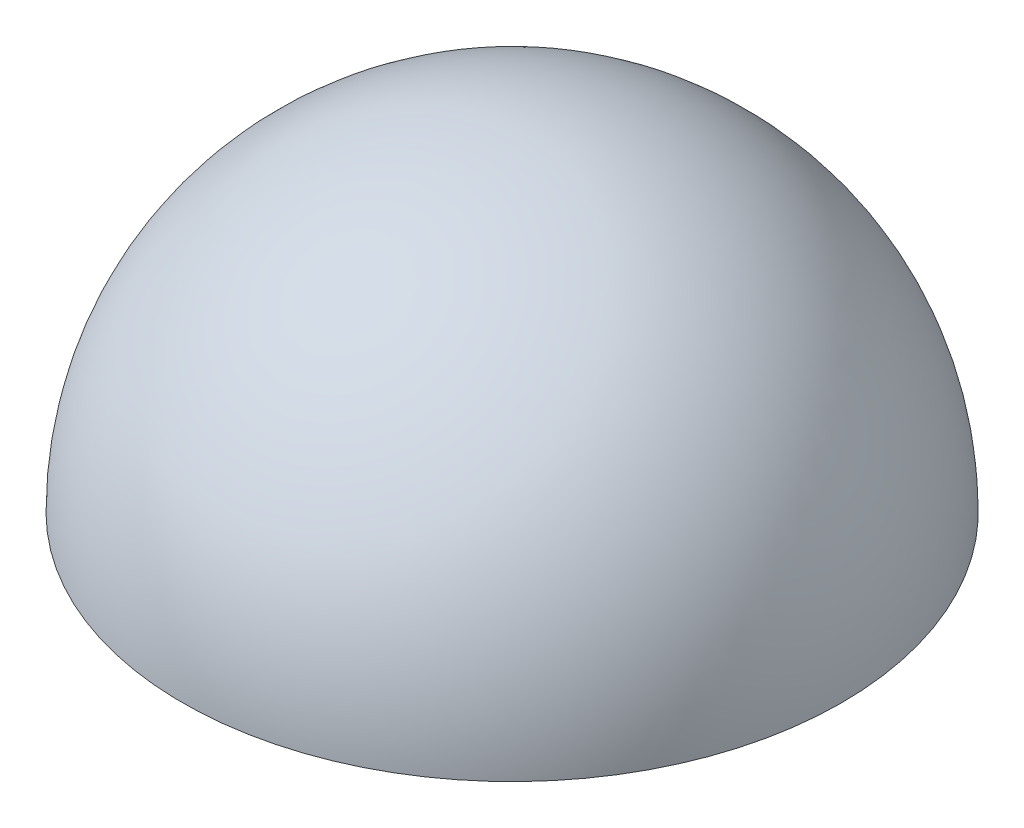
ISO-10303-21;
HEADER;
FILE_DESCRIPTION(('STEP AP214'),'2;1');
FILE_NAME('part.step','',(''),(''),'','','');
FILE_SCHEMA(('AUTOMOTIVE_DESIGN { 1 0 10303 214 1 1 1 1 }'));
ENDSEC;
DATA;
#1=APPLICATION_CONTEXT('core data for automotive mechanical design processes');
#2=APPLICATION_PROTOCOL_DEFINITION('international standard','automotive_design',2000,#1);
#3=PRODUCT_CONTEXT('',#1,'mechanical');
#4=PRODUCT('Part','Part','',(#3));
#5=PRODUCT_RELATED_PRODUCT_CATEGORY('part','',(#4));
#6=PRODUCT_DEFINITION_FORMATION('','',#4);
#7=PRODUCT_DEFINITION_CONTEXT('part definition',#1,'design');
#8=PRODUCT_DEFINITION('design','',#6,#7);
#9=PRODUCT_DEFINITION_SHAPE('','',#8);
#10=(LENGTH_UNIT() NAMED_UNIT(*) SI_UNIT(.MILLI.,.METRE.));
#11=(NAMED_UNIT(*) PLANE_ANGLE_UNIT() SI_UNIT($,.RADIAN.));
#12=(NAMED_UNIT(*) SI_UNIT($,.STERADIAN.) SOLID_ANGLE_UNIT());
#13=UNCERTAINTY_MEASURE_WITH_UNIT(LENGTH_MEASURE(1.E-05),#10,'distance_accuracy_value','');
#14=(GEOMETRIC_REPRESENTATION_CONTEXT(3) GLOBAL_UNCERTAINTY_ASSIGNED_CONTEXT((#13)) GLOBAL_UNIT_ASSIGNED_CONTEXT((#10,
#11,#12)) REPRESENTATION_CONTEXT('',''));
#15=CARTESIAN_POINT('',(0.,0.,0.));
#16=DIRECTION('',(0.,0.,1.));
#17=DIRECTION('',(1.,0.,0.));
#18=AXIS2_PLACEMENT_3D('',#15,#16,#17);
#19=CARTESIAN_POINT('',(-14.1918639717501,0.,-8.92807835927719));
#20=DIRECTION('',(0.294975335032854,0.,0.955504867450844));
#21=DIRECTION('',(0.955504867450844,0.,-0.294975335032854));
#22=AXIS2_PLACEMENT_3D('',#19,#20,#21);
#23=SPHERICAL_SURFACE('',#22,18.75);
#24=CARTESIAN_POINT('',(-14.1918639717501,0.,-8.92807835927719));
#25=DIRECTION('',(0.,-1.,0.));
#26=DIRECTION('',(0.563700736803671,0.,0.825979103444511));
#27=AXIS2_PLACEMENT_3D('',#24,#25,#26);
#28=SPHERICAL_SURFACE('',#27,18.75);
#29=CARTESIAN_POINT('',(-14.1918639717501,0.,-8.92807835927719));
#30=DIRECTION('',(0.,-1.,0.));
#31=DIRECTION('',(0.563700736803671,0.,0.825979103444511));
#32=AXIS2_PLACEMENT_3D('',#29,#30,#31);
#33=CIRCLE('',#32,18.75);
#34=CARTESIAN_POINT('',(-3.62247515668124,0.,6.5590298303074));
#35=VERTEX_POINT('',#34);
#36=EDGE_CURVE('E10',#35,#35,#33,.T.);
#37=ORIENTED_EDGE('',*,*,#36,.F.);
#38=EDGE_LOOP('',(#37));
#39=FACE_BOUND('',#38,.T.);
#40=ADVANCED_FACE('F30',(#39),#28,.T.);
#41=CARTESIAN_POINT('',(-20.8812827019772,0.,6.44629197689392));
#42=DIRECTION('',(0.,-1.,0.));
#43=DIRECTION('',(0.563700736803671,0.,0.825979103444511));
#44=AXIS2_PLACEMENT_3D('',#41,#42,#43);
#45=PLANE('',#44);
#46=ORIENTED_EDGE('',*,*,#36,.T.);
#47=EDGE_LOOP('',(#46));
#48=FACE_BOUND('',#47,.T.);
#49=ADVANCED_FACE('F37',(#48),#45,.T.);
#50=CLOSED_SHELL('',(#40,#49));
#51=MANIFOLD_SOLID_BREP('B2',#50);
#52=ADVANCED_BREP_SHAPE_REPRESENTATION('',(#18,#51),#14);
#53=SHAPE_DEFINITION_REPRESENTATION(#9,#52);
ENDSEC;
END-ISO-10303-21;
